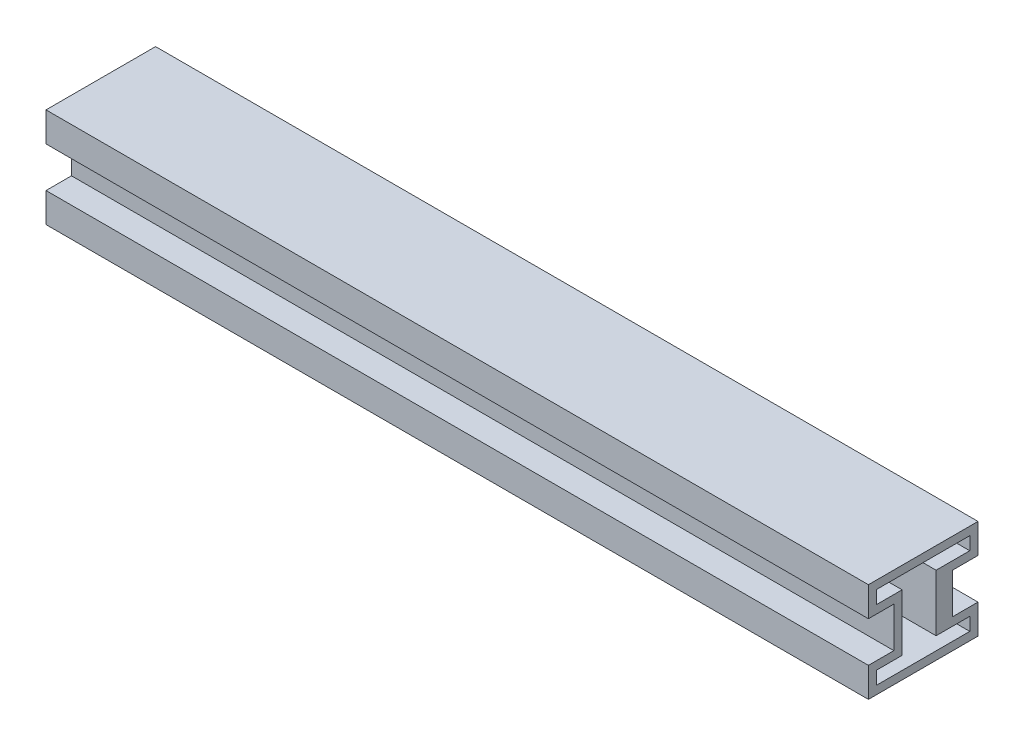
ISO-10303-21;
HEADER;
FILE_DESCRIPTION(('STEP AP214'),'2;1');
FILE_NAME('part.step','',(''),(''),'','','');
FILE_SCHEMA(('AUTOMOTIVE_DESIGN { 1 0 10303 214 1 1 1 1 }'));
ENDSEC;
DATA;
#1=APPLICATION_CONTEXT('core data for automotive mechanical design processes');
#2=APPLICATION_PROTOCOL_DEFINITION('international standard','automotive_design',2000,#1);
#3=PRODUCT_CONTEXT('',#1,'mechanical');
#4=PRODUCT('Part','Part','',(#3));
#5=PRODUCT_RELATED_PRODUCT_CATEGORY('part','',(#4));
#6=PRODUCT_DEFINITION_FORMATION('','',#4);
#7=PRODUCT_DEFINITION_CONTEXT('part definition',#1,'design');
#8=PRODUCT_DEFINITION('design','',#6,#7);
#9=PRODUCT_DEFINITION_SHAPE('','',#8);
#10=(LENGTH_UNIT() NAMED_UNIT(*) SI_UNIT(.MILLI.,.METRE.));
#11=(NAMED_UNIT(*) PLANE_ANGLE_UNIT() SI_UNIT($,.RADIAN.));
#12=(NAMED_UNIT(*) SI_UNIT($,.STERADIAN.) SOLID_ANGLE_UNIT());
#13=UNCERTAINTY_MEASURE_WITH_UNIT(LENGTH_MEASURE(1.E-05),#10,'distance_accuracy_value','');
#14=(GEOMETRIC_REPRESENTATION_CONTEXT(3) GLOBAL_UNCERTAINTY_ASSIGNED_CONTEXT((#13)) GLOBAL_UNIT_ASSIGNED_CONTEXT((#10,
#11,#12)) REPRESENTATION_CONTEXT('',''));
#15=CARTESIAN_POINT('',(0.,0.,0.));
#16=DIRECTION('',(0.,0.,1.));
#17=DIRECTION('',(1.,0.,0.));
#18=AXIS2_PLACEMENT_3D('',#15,#16,#17);
#19=CARTESIAN_POINT('',(1000.,-34.5295294792242,-25.6656272757451));
#20=DIRECTION('',(0.,-1.,0.));
#21=DIRECTION('',(0.,0.,-1.));
#22=AXIS2_PLACEMENT_3D('',#19,#20,#21);
#23=PLANE('',#22);
#24=DIRECTION('',(0.,0.,1.));
#25=VECTOR('',#24,1.);
#26=CARTESIAN_POINT('',(0.,-34.5295294792242,-25.6656272757451));
#27=LINE('',#26,#25);
#28=CARTESIAN_POINT('',(0.,-34.5295294792242,-56.6231364640151));
#29=VERTEX_POINT('',#28);
#30=CARTESIAN_POINT('',(0.,-34.5295294792242,-15.6656272757451));
#31=VERTEX_POINT('',#30);
#32=EDGE_CURVE('E784',#29,#31,#27,.T.);
#33=ORIENTED_EDGE('',*,*,#32,.F.);
#34=DIRECTION('',(-1.,0.,0.));
#35=VECTOR('',#34,1.);
#36=CARTESIAN_POINT('',(1000.,-34.5295294792242,-56.6231364640151));
#37=LINE('',#36,#35);
#38=CARTESIAN_POINT('',(1000.,-34.5295294792242,-56.6231364640151));
#39=VERTEX_POINT('',#38);
#40=EDGE_CURVE('E340',#39,#29,#37,.T.);
#41=ORIENTED_EDGE('',*,*,#40,.F.);
#42=DIRECTION('',(0.,0.,1.));
#43=VECTOR('',#42,1.);
#44=CARTESIAN_POINT('',(1000.,-34.5295294792242,-25.6656272757451));
#45=LINE('',#44,#43);
#46=CARTESIAN_POINT('',(1000.,-34.5295294792242,-15.6656272757451));
#47=VERTEX_POINT('',#46);
#48=EDGE_CURVE('E790',#39,#47,#45,.T.);
#49=ORIENTED_EDGE('',*,*,#48,.T.);
#50=DIRECTION('',(-1.,0.,0.));
#51=VECTOR('',#50,1.);
#52=CARTESIAN_POINT('',(1000.,-34.5295294792242,-15.6656272757451));
#53=LINE('',#52,#51);
#54=EDGE_CURVE('E12',#47,#31,#53,.T.);
#55=ORIENTED_EDGE('',*,*,#54,.T.);
#56=EDGE_LOOP('',(#33,#41,#49,#55));
#57=FACE_BOUND('',#56,.T.);
#58=ADVANCED_FACE('F111',(#57),#23,.T.);
#59=CARTESIAN_POINT('',(1000.,34.5295294792242,-15.6656272757452));
#60=DIRECTION('',(0.,1.,0.));
#61=DIRECTION('',(0.,0.,1.));
#62=AXIS2_PLACEMENT_3D('',#59,#60,#61);
#63=PLANE('',#62);
#64=DIRECTION('',(0.,0.,-1.));
#65=VECTOR('',#64,1.);
#66=CARTESIAN_POINT('',(0.,34.5295294792242,-15.6656272757452));
#67=LINE('',#66,#65);
#68=CARTESIAN_POINT('',(0.,34.5295294792242,-15.6656272757452));
#69=VERTEX_POINT('',#68);
#70=CARTESIAN_POINT('',(0.,34.5295294792242,-56.6231364640152));
#71=VERTEX_POINT('',#70);
#72=EDGE_CURVE('E783',#69,#71,#67,.T.);
#73=ORIENTED_EDGE('',*,*,#72,.F.);
#74=DIRECTION('',(-1.,0.,0.));
#75=VECTOR('',#74,1.);
#76=CARTESIAN_POINT('',(1000.,34.5295294792242,-15.6656272757452));
#77=LINE('',#76,#75);
#78=CARTESIAN_POINT('',(1000.,34.5295294792242,-15.6656272757452));
#79=VERTEX_POINT('',#78);
#80=EDGE_CURVE('E121',#79,#69,#77,.T.);
#81=ORIENTED_EDGE('',*,*,#80,.F.);
#82=DIRECTION('',(0.,0.,-1.));
#83=VECTOR('',#82,1.);
#84=CARTESIAN_POINT('',(1000.,34.5295294792242,-15.6656272757452));
#85=LINE('',#84,#83);
#86=CARTESIAN_POINT('',(1000.,34.5295294792242,-56.6231364640152));
#87=VERTEX_POINT('',#86);
#88=EDGE_CURVE('E794',#79,#87,#85,.T.);
#89=ORIENTED_EDGE('',*,*,#88,.T.);
#90=DIRECTION('',(-1.,0.,0.));
#91=VECTOR('',#90,1.);
#92=CARTESIAN_POINT('',(1000.,34.5295294792242,-56.6231364640152));
#93=LINE('',#92,#91);
#94=EDGE_CURVE('E343',#87,#71,#93,.T.);
#95=ORIENTED_EDGE('',*,*,#94,.T.);
#96=EDGE_LOOP('',(#73,#81,#89,#95));
#97=FACE_BOUND('',#96,.T.);
#98=ADVANCED_FACE('F505',(#97),#63,.T.);
#99=CARTESIAN_POINT('',(1000.,34.5295294792242,-15.6656272757452));
#100=DIRECTION('',(0.,0.,-1.));
#101=DIRECTION('',(0.,1.,0.));
#102=AXIS2_PLACEMENT_3D('',#99,#100,#101);
#103=PLANE('',#102);
#104=DIRECTION('',(0.,-1.,0.));
#105=VECTOR('',#104,1.);
#106=CARTESIAN_POINT('',(0.,34.5295294792242,-15.6656272757452));
#107=LINE('',#106,#105);
#108=EDGE_CURVE('E419',#69,#31,#107,.T.);
#109=ORIENTED_EDGE('',*,*,#108,.T.);
#110=ORIENTED_EDGE('',*,*,#54,.F.);
#111=DIRECTION('',(0.,-1.,0.));
#112=VECTOR('',#111,1.);
#113=CARTESIAN_POINT('',(1000.,34.5295294792242,-15.6656272757452));
#114=LINE('',#113,#112);
#115=EDGE_CURVE('E788',#79,#47,#114,.T.);
#116=ORIENTED_EDGE('',*,*,#115,.F.);
#117=ORIENTED_EDGE('',*,*,#80,.T.);
#118=EDGE_LOOP('',(#109,#110,#116,#117));
#119=FACE_BOUND('',#118,.T.);
#120=ADVANCED_FACE('F511',(#119),#103,.F.);
#121=CARTESIAN_POINT('',(0.,0.,0.));
#122=DIRECTION('',(-1.,0.,0.));
#123=DIRECTION('',(0.,0.,1.));
#124=AXIS2_PLACEMENT_3D('',#121,#122,#123);
#125=PLANE('',#124);
#126=ORIENTED_EDGE('',*,*,#108,.F.);
#127=ORIENTED_EDGE('',*,*,#72,.T.);
#128=DIRECTION('',(0.,-1.,0.));
#129=VECTOR('',#128,1.);
#130=CARTESIAN_POINT('',(0.,0.,-56.6231364640152));
#131=LINE('',#130,#129);
#132=CARTESIAN_POINT('',(0.,50.4051752167986,-56.6231364640152));
#133=VERTEX_POINT('',#132);
#134=EDGE_CURVE('E332',#133,#71,#131,.T.);
#135=ORIENTED_EDGE('',*,*,#134,.F.);
#136=DIRECTION('',(0.,0.,1.));
#137=VECTOR('',#136,1.);
#138=CARTESIAN_POINT('',(0.,50.4051752167986,0.));
#139=LINE('',#138,#137);
#140=CARTESIAN_POINT('',(0.,50.4051752167986,56.6231364640152));
#141=VERTEX_POINT('',#140);
#142=EDGE_CURVE('E329',#133,#141,#139,.T.);
#143=ORIENTED_EDGE('',*,*,#142,.T.);
#144=DIRECTION('',(0.,-1.,0.));
#145=VECTOR('',#144,1.);
#146=CARTESIAN_POINT('',(0.,0.,56.6231364640152));
#147=LINE('',#146,#145);
#148=CARTESIAN_POINT('',(0.,34.5295294792242,56.6231364640152));
#149=VERTEX_POINT('',#148);
#150=EDGE_CURVE('E326',#141,#149,#147,.T.);
#151=ORIENTED_EDGE('',*,*,#150,.T.);
#152=DIRECTION('',(0.,0.,-1.));
#153=VECTOR('',#152,1.);
#154=CARTESIAN_POINT('',(0.,34.5295294792242,0.));
#155=LINE('',#154,#153);
#156=CARTESIAN_POINT('',(0.,34.5295294792242,25.6656272757452));
#157=VERTEX_POINT('',#156);
#158=EDGE_CURVE('E323',#149,#157,#155,.T.);
#159=ORIENTED_EDGE('',*,*,#158,.T.);
#160=DIRECTION('',(0.,-1.,0.));
#161=VECTOR('',#160,1.);
#162=CARTESIAN_POINT('',(0.,0.,25.6656272757452));
#163=LINE('',#162,#161);
#164=CARTESIAN_POINT('',(0.,-34.5295294792242,25.6656272757452));
#165=VERTEX_POINT('',#164);
#166=EDGE_CURVE('E320',#157,#165,#163,.T.);
#167=ORIENTED_EDGE('',*,*,#166,.T.);
#168=DIRECTION('',(0.,0.,-1.));
#169=VECTOR('',#168,1.);
#170=CARTESIAN_POINT('',(0.,-34.5295294792242,0.));
#171=LINE('',#170,#169);
#172=CARTESIAN_POINT('',(0.,-34.5295294792242,56.6231364640152));
#173=VERTEX_POINT('',#172);
#174=EDGE_CURVE('E318',#173,#165,#171,.T.);
#175=ORIENTED_EDGE('',*,*,#174,.F.);
#176=DIRECTION('',(0.,1.,0.));
#177=VECTOR('',#176,1.);
#178=CARTESIAN_POINT('',(0.,0.,56.6231364640152));
#179=LINE('',#178,#177);
#180=CARTESIAN_POINT('',(0.,-50.4051752167986,56.6231364640152));
#181=VERTEX_POINT('',#180);
#182=EDGE_CURVE('E290',#181,#173,#179,.T.);
#183=ORIENTED_EDGE('',*,*,#182,.F.);
#184=DIRECTION('',(0.,0.,1.));
#185=VECTOR('',#184,1.);
#186=CARTESIAN_POINT('',(0.,-50.4051752167986,0.));
#187=LINE('',#186,#185);
#188=CARTESIAN_POINT('',(0.,-50.4051752167986,-56.6231364640151));
#189=VERTEX_POINT('',#188);
#190=EDGE_CURVE('E266',#189,#181,#187,.T.);
#191=ORIENTED_EDGE('',*,*,#190,.F.);
#192=DIRECTION('',(0.,1.,0.));
#193=VECTOR('',#192,1.);
#194=CARTESIAN_POINT('',(0.,0.,-56.6231364640151));
#195=LINE('',#194,#193);
#196=EDGE_CURVE('E300',#189,#29,#195,.T.);
#197=ORIENTED_EDGE('',*,*,#196,.T.);
#198=ORIENTED_EDGE('',*,*,#32,.T.);
#199=EDGE_LOOP('',(#126,#127,#135,#143,#151,#159,#167,#175,#183,#191,#197,#198));
#200=FACE_BOUND('',#199,.T.);
#201=DIRECTION('',(0.,0.,1.));
#202=VECTOR('',#201,1.);
#203=CARTESIAN_POINT('',(0.,-60.4051752167986,0.));
#204=LINE('',#203,#202);
#205=CARTESIAN_POINT('',(0.,-60.4051752167986,-66.6231364640151));
#206=VERTEX_POINT('',#205);
#207=CARTESIAN_POINT('',(0.,-60.4051752167986,66.6231364640152));
#208=VERTEX_POINT('',#207);
#209=EDGE_CURVE('E339',#206,#208,#204,.T.);
#210=ORIENTED_EDGE('',*,*,#209,.T.);
#211=DIRECTION('',(0.,1.,0.));
#212=VECTOR('',#211,1.);
#213=CARTESIAN_POINT('',(0.,0.,66.6231364640152));
#214=LINE('',#213,#212);
#215=CARTESIAN_POINT('',(0.,-24.5295294792242,66.6231364640152));
#216=VERTEX_POINT('',#215);
#217=EDGE_CURVE('E389',#208,#216,#214,.T.);
#218=ORIENTED_EDGE('',*,*,#217,.T.);
#219=DIRECTION('',(0.,0.,-1.));
#220=VECTOR('',#219,1.);
#221=CARTESIAN_POINT('',(0.,-24.5295294792242,0.));
#222=LINE('',#221,#220);
#223=CARTESIAN_POINT('',(0.,-24.5295294792242,35.6656272757452));
#224=VERTEX_POINT('',#223);
#225=EDGE_CURVE('E392',#216,#224,#222,.T.);
#226=ORIENTED_EDGE('',*,*,#225,.T.);
#227=DIRECTION('',(0.,-1.,0.));
#228=VECTOR('',#227,1.);
#229=CARTESIAN_POINT('',(0.,0.,35.6656272757452));
#230=LINE('',#229,#228);
#231=CARTESIAN_POINT('',(0.,24.5295294792242,35.6656272757452));
#232=VERTEX_POINT('',#231);
#233=EDGE_CURVE('E395',#232,#224,#230,.T.);
#234=ORIENTED_EDGE('',*,*,#233,.F.);
#235=DIRECTION('',(0.,0.,-1.));
#236=VECTOR('',#235,1.);
#237=CARTESIAN_POINT('',(0.,24.5295294792242,0.));
#238=LINE('',#237,#236);
#239=CARTESIAN_POINT('',(0.,24.5295294792242,66.6231364640152));
#240=VERTEX_POINT('',#239);
#241=EDGE_CURVE('E398',#240,#232,#238,.T.);
#242=ORIENTED_EDGE('',*,*,#241,.F.);
#243=DIRECTION('',(0.,-1.,0.));
#244=VECTOR('',#243,1.);
#245=CARTESIAN_POINT('',(0.,0.,66.6231364640152));
#246=LINE('',#245,#244);
#247=CARTESIAN_POINT('',(0.,60.4051752167986,66.6231364640152));
#248=VERTEX_POINT('',#247);
#249=EDGE_CURVE('E400',#248,#240,#246,.T.);
#250=ORIENTED_EDGE('',*,*,#249,.F.);
#251=DIRECTION('',(0.,0.,1.));
#252=VECTOR('',#251,1.);
#253=CARTESIAN_POINT('',(0.,60.4051752167986,0.));
#254=LINE('',#253,#252);
#255=CARTESIAN_POINT('',(0.,60.4051752167986,-66.6231364640152));
#256=VERTEX_POINT('',#255);
#257=EDGE_CURVE('E402',#256,#248,#254,.T.);
#258=ORIENTED_EDGE('',*,*,#257,.F.);
#259=DIRECTION('',(0.,-1.,0.));
#260=VECTOR('',#259,1.);
#261=CARTESIAN_POINT('',(0.,0.,-66.6231364640152));
#262=LINE('',#261,#260);
#263=CARTESIAN_POINT('',(0.,24.5295294792242,-66.6231364640152));
#264=VERTEX_POINT('',#263);
#265=EDGE_CURVE('E404',#256,#264,#262,.T.);
#266=ORIENTED_EDGE('',*,*,#265,.T.);
#267=DIRECTION('',(0.,0.,1.));
#268=VECTOR('',#267,1.);
#269=CARTESIAN_POINT('',(0.,24.5295294792242,0.));
#270=LINE('',#269,#268);
#271=CARTESIAN_POINT('',(0.,24.5295294792242,-35.6656272757452));
#272=VERTEX_POINT('',#271);
#273=EDGE_CURVE('E407',#264,#272,#270,.T.);
#274=ORIENTED_EDGE('',*,*,#273,.T.);
#275=DIRECTION('',(0.,-1.,0.));
#276=VECTOR('',#275,1.);
#277=CARTESIAN_POINT('',(0.,0.,-35.6656272757451));
#278=LINE('',#277,#276);
#279=CARTESIAN_POINT('',(0.,-24.5295294792242,-35.6656272757451));
#280=VERTEX_POINT('',#279);
#281=EDGE_CURVE('E410',#272,#280,#278,.T.);
#282=ORIENTED_EDGE('',*,*,#281,.T.);
#283=DIRECTION('',(0.,0.,1.));
#284=VECTOR('',#283,1.);
#285=CARTESIAN_POINT('',(0.,-24.5295294792242,0.));
#286=LINE('',#285,#284);
#287=CARTESIAN_POINT('',(0.,-24.5295294792242,-66.6231364640151));
#288=VERTEX_POINT('',#287);
#289=EDGE_CURVE('E413',#288,#280,#286,.T.);
#290=ORIENTED_EDGE('',*,*,#289,.F.);
#291=DIRECTION('',(0.,1.,0.));
#292=VECTOR('',#291,1.);
#293=CARTESIAN_POINT('',(0.,0.,-66.6231364640151));
#294=LINE('',#293,#292);
#295=EDGE_CURVE('E360',#206,#288,#294,.T.);
#296=ORIENTED_EDGE('',*,*,#295,.F.);
#297=EDGE_LOOP('',(#210,#218,#226,#234,#242,#250,#258,#266,#274,#282,#290,#296));
#298=FACE_BOUND('',#297,.T.);
#299=ADVANCED_FACE('F452',(#200,#298),#125,.T.);
#300=CARTESIAN_POINT('',(1000.,0.,0.));
#301=DIRECTION('',(-1.,0.,0.));
#302=DIRECTION('',(0.,0.,1.));
#303=AXIS2_PLACEMENT_3D('',#300,#301,#302);
#304=PLANE('',#303);
#305=ORIENTED_EDGE('',*,*,#115,.T.);
#306=ORIENTED_EDGE('',*,*,#48,.F.);
#307=DIRECTION('',(0.,1.,0.));
#308=VECTOR('',#307,1.);
#309=CARTESIAN_POINT('',(1000.,0.,-56.6231364640151));
#310=LINE('',#309,#308);
#311=CARTESIAN_POINT('',(1000.,-50.4051752167986,-56.6231364640151));
#312=VERTEX_POINT('',#311);
#313=EDGE_CURVE('E313',#312,#39,#310,.T.);
#314=ORIENTED_EDGE('',*,*,#313,.F.);
#315=DIRECTION('',(0.,0.,1.));
#316=VECTOR('',#315,1.);
#317=CARTESIAN_POINT('',(1000.,-50.4051752167986,0.));
#318=LINE('',#317,#316);
#319=CARTESIAN_POINT('',(1000.,-50.4051752167986,56.6231364640152));
#320=VERTEX_POINT('',#319);
#321=EDGE_CURVE('E298',#312,#320,#318,.T.);
#322=ORIENTED_EDGE('',*,*,#321,.T.);
#323=DIRECTION('',(0.,1.,0.));
#324=VECTOR('',#323,1.);
#325=CARTESIAN_POINT('',(1000.,0.,56.6231364640152));
#326=LINE('',#325,#324);
#327=CARTESIAN_POINT('',(1000.,-34.5295294792242,56.6231364640152));
#328=VERTEX_POINT('',#327);
#329=EDGE_CURVE('E283',#320,#328,#326,.T.);
#330=ORIENTED_EDGE('',*,*,#329,.T.);
#331=DIRECTION('',(0.,0.,-1.));
#332=VECTOR('',#331,1.);
#333=CARTESIAN_POINT('',(1000.,-34.5295294792242,0.));
#334=LINE('',#333,#332);
#335=CARTESIAN_POINT('',(1000.,-34.5295294792242,25.6656272757452));
#336=VERTEX_POINT('',#335);
#337=EDGE_CURVE('E272',#328,#336,#334,.T.);
#338=ORIENTED_EDGE('',*,*,#337,.T.);
#339=DIRECTION('',(0.,-1.,0.));
#340=VECTOR('',#339,1.);
#341=CARTESIAN_POINT('',(1000.,0.,25.6656272757452));
#342=LINE('',#341,#340);
#343=CARTESIAN_POINT('',(1000.,34.5295294792242,25.6656272757452));
#344=VERTEX_POINT('',#343);
#345=EDGE_CURVE('E282',#344,#336,#342,.T.);
#346=ORIENTED_EDGE('',*,*,#345,.F.);
#347=DIRECTION('',(0.,0.,-1.));
#348=VECTOR('',#347,1.);
#349=CARTESIAN_POINT('',(1000.,34.5295294792242,0.));
#350=LINE('',#349,#348);
#351=CARTESIAN_POINT('',(1000.,34.5295294792242,56.6231364640152));
#352=VERTEX_POINT('',#351);
#353=EDGE_CURVE('E304',#352,#344,#350,.T.);
#354=ORIENTED_EDGE('',*,*,#353,.F.);
#355=DIRECTION('',(0.,-1.,0.));
#356=VECTOR('',#355,1.);
#357=CARTESIAN_POINT('',(1000.,0.,56.6231364640152));
#358=LINE('',#357,#356);
#359=CARTESIAN_POINT('',(1000.,50.4051752167986,56.6231364640152));
#360=VERTEX_POINT('',#359);
#361=EDGE_CURVE('E306',#360,#352,#358,.T.);
#362=ORIENTED_EDGE('',*,*,#361,.F.);
#363=DIRECTION('',(0.,0.,1.));
#364=VECTOR('',#363,1.);
#365=CARTESIAN_POINT('',(1000.,50.4051752167986,0.));
#366=LINE('',#365,#364);
#367=CARTESIAN_POINT('',(1000.,50.4051752167986,-56.6231364640152));
#368=VERTEX_POINT('',#367);
#369=EDGE_CURVE('E308',#368,#360,#366,.T.);
#370=ORIENTED_EDGE('',*,*,#369,.F.);
#371=DIRECTION('',(0.,-1.,0.));
#372=VECTOR('',#371,1.);
#373=CARTESIAN_POINT('',(1000.,0.,-56.6231364640152));
#374=LINE('',#373,#372);
#375=EDGE_CURVE('E310',#368,#87,#374,.T.);
#376=ORIENTED_EDGE('',*,*,#375,.T.);
#377=ORIENTED_EDGE('',*,*,#88,.F.);
#378=EDGE_LOOP('',(#305,#306,#314,#322,#330,#338,#346,#354,#362,#370,#376,#377));
#379=FACE_BOUND('',#378,.T.);
#380=DIRECTION('',(0.,0.,1.));
#381=VECTOR('',#380,1.);
#382=CARTESIAN_POINT('',(1000.,-60.4051752167986,0.));
#383=LINE('',#382,#381);
#384=CARTESIAN_POINT('',(1000.,-60.4051752167986,-66.6231364640151));
#385=VERTEX_POINT('',#384);
#386=CARTESIAN_POINT('',(1000.,-60.4051752167986,66.6231364640152));
#387=VERTEX_POINT('',#386);
#388=EDGE_CURVE('E356',#385,#387,#383,.T.);
#389=ORIENTED_EDGE('',*,*,#388,.F.);
#390=DIRECTION('',(0.,1.,0.));
#391=VECTOR('',#390,1.);
#392=CARTESIAN_POINT('',(1000.,0.,-66.6231364640151));
#393=LINE('',#392,#391);
#394=CARTESIAN_POINT('',(1000.,-24.5295294792242,-66.6231364640151));
#395=VERTEX_POINT('',#394);
#396=EDGE_CURVE('E385',#385,#395,#393,.T.);
#397=ORIENTED_EDGE('',*,*,#396,.T.);
#398=DIRECTION('',(0.,0.,1.));
#399=VECTOR('',#398,1.);
#400=CARTESIAN_POINT('',(1000.,-24.5295294792242,0.));
#401=LINE('',#400,#399);
#402=CARTESIAN_POINT('',(1000.,-24.5295294792242,-35.6656272757451));
#403=VERTEX_POINT('',#402);
#404=EDGE_CURVE('E383',#395,#403,#401,.T.);
#405=ORIENTED_EDGE('',*,*,#404,.T.);
#406=DIRECTION('',(0.,-1.,0.));
#407=VECTOR('',#406,1.);
#408=CARTESIAN_POINT('',(1000.,0.,-35.6656272757451));
#409=LINE('',#408,#407);
#410=CARTESIAN_POINT('',(1000.,24.5295294792242,-35.6656272757452));
#411=VERTEX_POINT('',#410);
#412=EDGE_CURVE('E380',#411,#403,#409,.T.);
#413=ORIENTED_EDGE('',*,*,#412,.F.);
#414=DIRECTION('',(0.,0.,1.));
#415=VECTOR('',#414,1.);
#416=CARTESIAN_POINT('',(1000.,24.5295294792242,0.));
#417=LINE('',#416,#415);
#418=CARTESIAN_POINT('',(1000.,24.5295294792242,-66.6231364640152));
#419=VERTEX_POINT('',#418);
#420=EDGE_CURVE('E377',#419,#411,#417,.T.);
#421=ORIENTED_EDGE('',*,*,#420,.F.);
#422=DIRECTION('',(0.,-1.,0.));
#423=VECTOR('',#422,1.);
#424=CARTESIAN_POINT('',(1000.,0.,-66.6231364640152));
#425=LINE('',#424,#423);
#426=CARTESIAN_POINT('',(1000.,60.4051752167986,-66.6231364640152));
#427=VERTEX_POINT('',#426);
#428=EDGE_CURVE('E374',#427,#419,#425,.T.);
#429=ORIENTED_EDGE('',*,*,#428,.F.);
#430=DIRECTION('',(0.,0.,1.));
#431=VECTOR('',#430,1.);
#432=CARTESIAN_POINT('',(1000.,60.4051752167986,0.));
#433=LINE('',#432,#431);
#434=CARTESIAN_POINT('',(1000.,60.4051752167986,66.6231364640152));
#435=VERTEX_POINT('',#434);
#436=EDGE_CURVE('E372',#427,#435,#433,.T.);
#437=ORIENTED_EDGE('',*,*,#436,.T.);
#438=DIRECTION('',(0.,-1.,0.));
#439=VECTOR('',#438,1.);
#440=CARTESIAN_POINT('',(1000.,0.,66.6231364640152));
#441=LINE('',#440,#439);
#442=CARTESIAN_POINT('',(1000.,24.5295294792242,66.6231364640152));
#443=VERTEX_POINT('',#442);
#444=EDGE_CURVE('E370',#435,#443,#441,.T.);
#445=ORIENTED_EDGE('',*,*,#444,.T.);
#446=DIRECTION('',(0.,0.,-1.));
#447=VECTOR('',#446,1.);
#448=CARTESIAN_POINT('',(1000.,24.5295294792242,0.));
#449=LINE('',#448,#447);
#450=CARTESIAN_POINT('',(1000.,24.5295294792242,35.6656272757452));
#451=VERTEX_POINT('',#450);
#452=EDGE_CURVE('E368',#443,#451,#449,.T.);
#453=ORIENTED_EDGE('',*,*,#452,.T.);
#454=DIRECTION('',(0.,-1.,0.));
#455=VECTOR('',#454,1.);
#456=CARTESIAN_POINT('',(1000.,0.,35.6656272757452));
#457=LINE('',#456,#455);
#458=CARTESIAN_POINT('',(1000.,-24.5295294792242,35.6656272757452));
#459=VERTEX_POINT('',#458);
#460=EDGE_CURVE('E366',#451,#459,#457,.T.);
#461=ORIENTED_EDGE('',*,*,#460,.T.);
#462=DIRECTION('',(0.,0.,-1.));
#463=VECTOR('',#462,1.);
#464=CARTESIAN_POINT('',(1000.,-24.5295294792242,0.));
#465=LINE('',#464,#463);
#466=CARTESIAN_POINT('',(1000.,-24.5295294792242,66.6231364640152));
#467=VERTEX_POINT('',#466);
#468=EDGE_CURVE('E363',#467,#459,#465,.T.);
#469=ORIENTED_EDGE('',*,*,#468,.F.);
#470=DIRECTION('',(0.,1.,0.));
#471=VECTOR('',#470,1.);
#472=CARTESIAN_POINT('',(1000.,0.,66.6231364640152));
#473=LINE('',#472,#471);
#474=EDGE_CURVE('E359',#387,#467,#473,.T.);
#475=ORIENTED_EDGE('',*,*,#474,.F.);
#476=EDGE_LOOP('',(#389,#397,#405,#413,#421,#429,#437,#445,#453,#461,#469,#475));
#477=FACE_BOUND('',#476,.T.);
#478=ADVANCED_FACE('F294',(#379,#477),#304,.F.);
#479=CARTESIAN_POINT('',(1000.,0.,-66.6231364640151));
#480=DIRECTION('',(0.,0.,1.));
#481=DIRECTION('',(1.,0.,0.));
#482=AXIS2_PLACEMENT_3D('',#479,#480,#481);
#483=PLANE('',#482);
#484=ORIENTED_EDGE('',*,*,#295,.T.);
#485=DIRECTION('',(-1.,0.,0.));
#486=VECTOR('',#485,1.);
#487=CARTESIAN_POINT('',(1000.,-24.5295294792242,-66.6231364640151));
#488=LINE('',#487,#486);
#489=EDGE_CURVE('E420',#395,#288,#488,.T.);
#490=ORIENTED_EDGE('',*,*,#489,.F.);
#491=ORIENTED_EDGE('',*,*,#396,.F.);
#492=DIRECTION('',(-1.,0.,0.));
#493=VECTOR('',#492,1.);
#494=CARTESIAN_POINT('',(1000.,-60.4051752167986,-66.6231364640151));
#495=LINE('',#494,#493);
#496=EDGE_CURVE('E417',#385,#206,#495,.T.);
#497=ORIENTED_EDGE('',*,*,#496,.T.);
#498=EDGE_LOOP('',(#484,#490,#491,#497));
#499=FACE_BOUND('',#498,.T.);
#500=ADVANCED_FACE('F456',(#499),#483,.F.);
#501=CARTESIAN_POINT('',(1000.,-24.5295294792242,0.));
#502=DIRECTION('',(0.,-1.,0.));
#503=DIRECTION('',(0.,0.,-1.));
#504=AXIS2_PLACEMENT_3D('',#501,#502,#503);
#505=PLANE('',#504);
#506=ORIENTED_EDGE('',*,*,#289,.T.);
#507=DIRECTION('',(-1.,0.,0.));
#508=VECTOR('',#507,1.);
#509=CARTESIAN_POINT('',(1000.,-24.5295294792242,-35.6656272757451));
#510=LINE('',#509,#508);
#511=EDGE_CURVE('E423',#403,#280,#510,.T.);
#512=ORIENTED_EDGE('',*,*,#511,.F.);
#513=ORIENTED_EDGE('',*,*,#404,.F.);
#514=ORIENTED_EDGE('',*,*,#489,.T.);
#515=EDGE_LOOP('',(#506,#512,#513,#514));
#516=FACE_BOUND('',#515,.T.);
#517=ADVANCED_FACE('F460',(#516),#505,.F.);
#518=CARTESIAN_POINT('',(1000.,0.,-35.6656272757451));
#519=DIRECTION('',(0.,0.,-1.));
#520=DIRECTION('',(0.,1.,0.));
#521=AXIS2_PLACEMENT_3D('',#518,#519,#520);
#522=PLANE('',#521);
#523=ORIENTED_EDGE('',*,*,#281,.F.);
#524=DIRECTION('',(-1.,0.,0.));
#525=VECTOR('',#524,1.);
#526=CARTESIAN_POINT('',(1000.,24.5295294792242,-35.6656272757452));
#527=LINE('',#526,#525);
#528=EDGE_CURVE('E425',#411,#272,#527,.T.);
#529=ORIENTED_EDGE('',*,*,#528,.F.);
#530=ORIENTED_EDGE('',*,*,#412,.T.);
#531=ORIENTED_EDGE('',*,*,#511,.T.);
#532=EDGE_LOOP('',(#523,#529,#530,#531));
#533=FACE_BOUND('',#532,.T.);
#534=ADVANCED_FACE('F495',(#533),#522,.T.);
#535=CARTESIAN_POINT('',(1000.,24.5295294792242,0.));
#536=DIRECTION('',(0.,-1.,0.));
#537=DIRECTION('',(0.,0.,-1.));
#538=AXIS2_PLACEMENT_3D('',#535,#536,#537);
#539=PLANE('',#538);
#540=ORIENTED_EDGE('',*,*,#273,.F.);
#541=DIRECTION('',(-1.,0.,0.));
#542=VECTOR('',#541,1.);
#543=CARTESIAN_POINT('',(1000.,24.5295294792242,-66.6231364640152));
#544=LINE('',#543,#542);
#545=EDGE_CURVE('E427',#419,#264,#544,.T.);
#546=ORIENTED_EDGE('',*,*,#545,.F.);
#547=ORIENTED_EDGE('',*,*,#420,.T.);
#548=ORIENTED_EDGE('',*,*,#528,.T.);
#549=EDGE_LOOP('',(#540,#546,#547,#548));
#550=FACE_BOUND('',#549,.T.);
#551=ADVANCED_FACE('F492',(#550),#539,.T.);
#552=CARTESIAN_POINT('',(1000.,0.,-66.6231364640152));
#553=DIRECTION('',(0.,0.,-1.));
#554=DIRECTION('',(-1.,0.,0.));
#555=AXIS2_PLACEMENT_3D('',#552,#553,#554);
#556=PLANE('',#555);
#557=ORIENTED_EDGE('',*,*,#265,.F.);
#558=DIRECTION('',(-1.,0.,0.));
#559=VECTOR('',#558,1.);
#560=CARTESIAN_POINT('',(1000.,60.4051752167986,-66.6231364640152));
#561=LINE('',#560,#559);
#562=EDGE_CURVE('E429',#427,#256,#561,.T.);
#563=ORIENTED_EDGE('',*,*,#562,.F.);
#564=ORIENTED_EDGE('',*,*,#428,.T.);
#565=ORIENTED_EDGE('',*,*,#545,.T.);
#566=EDGE_LOOP('',(#557,#563,#564,#565));
#567=FACE_BOUND('',#566,.T.);
#568=ADVANCED_FACE('F487',(#567),#556,.T.);
#569=CARTESIAN_POINT('',(1000.,60.4051752167986,0.));
#570=DIRECTION('',(0.,-1.,0.));
#571=DIRECTION('',(0.,0.,-1.));
#572=AXIS2_PLACEMENT_3D('',#569,#570,#571);
#573=PLANE('',#572);
#574=ORIENTED_EDGE('',*,*,#257,.T.);
#575=DIRECTION('',(-1.,0.,0.));
#576=VECTOR('',#575,1.);
#577=CARTESIAN_POINT('',(1000.,60.4051752167986,66.6231364640152));
#578=LINE('',#577,#576);
#579=EDGE_CURVE('E431',#435,#248,#578,.T.);
#580=ORIENTED_EDGE('',*,*,#579,.F.);
#581=ORIENTED_EDGE('',*,*,#436,.F.);
#582=ORIENTED_EDGE('',*,*,#562,.T.);
#583=EDGE_LOOP('',(#574,#580,#581,#582));
#584=FACE_BOUND('',#583,.T.);
#585=ADVANCED_FACE('F569',(#584),#573,.F.);
#586=CARTESIAN_POINT('',(1000.,0.,66.6231364640152));
#587=DIRECTION('',(0.,0.,-1.));
#588=DIRECTION('',(-1.,0.,0.));
#589=AXIS2_PLACEMENT_3D('',#586,#587,#588);
#590=PLANE('',#589);
#591=ORIENTED_EDGE('',*,*,#249,.T.);
#592=DIRECTION('',(-1.,0.,0.));
#593=VECTOR('',#592,1.);
#594=CARTESIAN_POINT('',(1000.,24.5295294792242,66.6231364640152));
#595=LINE('',#594,#593);
#596=EDGE_CURVE('E434',#443,#240,#595,.T.);
#597=ORIENTED_EDGE('',*,*,#596,.F.);
#598=ORIENTED_EDGE('',*,*,#444,.F.);
#599=ORIENTED_EDGE('',*,*,#579,.T.);
#600=EDGE_LOOP('',(#591,#597,#598,#599));
#601=FACE_BOUND('',#600,.T.);
#602=ADVANCED_FACE('F481',(#601),#590,.F.);
#603=CARTESIAN_POINT('',(1000.,24.5295294792242,0.));
#604=DIRECTION('',(0.,1.,0.));
#605=DIRECTION('',(0.,0.,1.));
#606=AXIS2_PLACEMENT_3D('',#603,#604,#605);
#607=PLANE('',#606);
#608=ORIENTED_EDGE('',*,*,#241,.T.);
#609=DIRECTION('',(-1.,0.,0.));
#610=VECTOR('',#609,1.);
#611=CARTESIAN_POINT('',(1000.,24.5295294792242,35.6656272757452));
#612=LINE('',#611,#610);
#613=EDGE_CURVE('E437',#451,#232,#612,.T.);
#614=ORIENTED_EDGE('',*,*,#613,.F.);
#615=ORIENTED_EDGE('',*,*,#452,.F.);
#616=ORIENTED_EDGE('',*,*,#596,.T.);
#617=EDGE_LOOP('',(#608,#614,#615,#616));
#618=FACE_BOUND('',#617,.T.);
#619=ADVANCED_FACE('F477',(#618),#607,.F.);
#620=CARTESIAN_POINT('',(1000.,0.,35.6656272757452));
#621=DIRECTION('',(0.,0.,-1.));
#622=DIRECTION('',(0.,1.,0.));
#623=AXIS2_PLACEMENT_3D('',#620,#621,#622);
#624=PLANE('',#623);
#625=ORIENTED_EDGE('',*,*,#233,.T.);
#626=DIRECTION('',(-1.,0.,0.));
#627=VECTOR('',#626,1.);
#628=CARTESIAN_POINT('',(1000.,-24.5295294792242,35.6656272757452));
#629=LINE('',#628,#627);
#630=EDGE_CURVE('E440',#459,#224,#629,.T.);
#631=ORIENTED_EDGE('',*,*,#630,.F.);
#632=ORIENTED_EDGE('',*,*,#460,.F.);
#633=ORIENTED_EDGE('',*,*,#613,.T.);
#634=EDGE_LOOP('',(#625,#631,#632,#633));
#635=FACE_BOUND('',#634,.T.);
#636=ADVANCED_FACE('F473',(#635),#624,.F.);
#637=CARTESIAN_POINT('',(1000.,-24.5295294792242,0.));
#638=DIRECTION('',(0.,1.,0.));
#639=DIRECTION('',(0.,0.,1.));
#640=AXIS2_PLACEMENT_3D('',#637,#638,#639);
#641=PLANE('',#640);
#642=ORIENTED_EDGE('',*,*,#225,.F.);
#643=DIRECTION('',(-1.,0.,0.));
#644=VECTOR('',#643,1.);
#645=CARTESIAN_POINT('',(1000.,-24.5295294792242,66.6231364640152));
#646=LINE('',#645,#644);
#647=EDGE_CURVE('E441',#467,#216,#646,.T.);
#648=ORIENTED_EDGE('',*,*,#647,.F.);
#649=ORIENTED_EDGE('',*,*,#468,.T.);
#650=ORIENTED_EDGE('',*,*,#630,.T.);
#651=EDGE_LOOP('',(#642,#648,#649,#650));
#652=FACE_BOUND('',#651,.T.);
#653=ADVANCED_FACE('F468',(#652),#641,.T.);
#654=CARTESIAN_POINT('',(1000.,0.,66.6231364640152));
#655=DIRECTION('',(0.,0.,1.));
#656=DIRECTION('',(1.,0.,0.));
#657=AXIS2_PLACEMENT_3D('',#654,#655,#656);
#658=PLANE('',#657);
#659=ORIENTED_EDGE('',*,*,#217,.F.);
#660=DIRECTION('',(-1.,0.,0.));
#661=VECTOR('',#660,1.);
#662=CARTESIAN_POINT('',(1000.,-60.4051752167986,66.6231364640152));
#663=LINE('',#662,#661);
#664=EDGE_CURVE('E115',#387,#208,#663,.T.);
#665=ORIENTED_EDGE('',*,*,#664,.F.);
#666=ORIENTED_EDGE('',*,*,#474,.T.);
#667=ORIENTED_EDGE('',*,*,#647,.T.);
#668=EDGE_LOOP('',(#659,#665,#666,#667));
#669=FACE_BOUND('',#668,.T.);
#670=ADVANCED_FACE('F449',(#669),#658,.T.);
#671=CARTESIAN_POINT('',(1000.,-60.4051752167986,0.));
#672=DIRECTION('',(0.,-1.,0.));
#673=DIRECTION('',(0.,0.,-1.));
#674=AXIS2_PLACEMENT_3D('',#671,#672,#673);
#675=PLANE('',#674);
#676=ORIENTED_EDGE('',*,*,#209,.F.);
#677=ORIENTED_EDGE('',*,*,#496,.F.);
#678=ORIENTED_EDGE('',*,*,#388,.T.);
#679=ORIENTED_EDGE('',*,*,#664,.T.);
#680=EDGE_LOOP('',(#676,#677,#678,#679));
#681=FACE_BOUND('',#680,.T.);
#682=ADVANCED_FACE('F113',(#681),#675,.T.);
#683=CARTESIAN_POINT('',(1000.,0.,56.6231364640152));
#684=DIRECTION('',(0.,0.,1.));
#685=DIRECTION('',(1.,0.,0.));
#686=AXIS2_PLACEMENT_3D('',#683,#684,#685);
#687=PLANE('',#686);
#688=ORIENTED_EDGE('',*,*,#182,.T.);
#689=DIRECTION('',(-1.,0.,0.));
#690=VECTOR('',#689,1.);
#691=CARTESIAN_POINT('',(1000.,-34.5295294792242,56.6231364640152));
#692=LINE('',#691,#690);
#693=EDGE_CURVE('E276',#328,#173,#692,.T.);
#694=ORIENTED_EDGE('',*,*,#693,.F.);
#695=ORIENTED_EDGE('',*,*,#329,.F.);
#696=DIRECTION('',(-1.,0.,0.));
#697=VECTOR('',#696,1.);
#698=CARTESIAN_POINT('',(1000.,-50.4051752167986,56.6231364640152));
#699=LINE('',#698,#697);
#700=EDGE_CURVE('E292',#320,#181,#699,.T.);
#701=ORIENTED_EDGE('',*,*,#700,.T.);
#702=EDGE_LOOP('',(#688,#694,#695,#701));
#703=FACE_BOUND('',#702,.T.);
#704=ADVANCED_FACE('F287',(#703),#687,.F.);
#705=CARTESIAN_POINT('',(1000.,-34.5295294792242,0.));
#706=DIRECTION('',(0.,1.,0.));
#707=DIRECTION('',(0.,0.,1.));
#708=AXIS2_PLACEMENT_3D('',#705,#706,#707);
#709=PLANE('',#708);
#710=ORIENTED_EDGE('',*,*,#174,.T.);
#711=DIRECTION('',(-1.,0.,0.));
#712=VECTOR('',#711,1.);
#713=CARTESIAN_POINT('',(1000.,-34.5295294792242,25.6656272757452));
#714=LINE('',#713,#712);
#715=EDGE_CURVE('E278',#336,#165,#714,.T.);
#716=ORIENTED_EDGE('',*,*,#715,.F.);
#717=ORIENTED_EDGE('',*,*,#337,.F.);
#718=ORIENTED_EDGE('',*,*,#693,.T.);
#719=EDGE_LOOP('',(#710,#716,#717,#718));
#720=FACE_BOUND('',#719,.T.);
#721=ADVANCED_FACE('F275',(#720),#709,.F.);
#722=CARTESIAN_POINT('',(1000.,0.,25.6656272757452));
#723=DIRECTION('',(0.,0.,-1.));
#724=DIRECTION('',(0.,1.,0.));
#725=AXIS2_PLACEMENT_3D('',#722,#723,#724);
#726=PLANE('',#725);
#727=ORIENTED_EDGE('',*,*,#166,.F.);
#728=DIRECTION('',(-1.,0.,0.));
#729=VECTOR('',#728,1.);
#730=CARTESIAN_POINT('',(1000.,34.5295294792242,25.6656272757452));
#731=LINE('',#730,#729);
#732=EDGE_CURVE('E352',#344,#157,#731,.T.);
#733=ORIENTED_EDGE('',*,*,#732,.F.);
#734=ORIENTED_EDGE('',*,*,#345,.T.);
#735=ORIENTED_EDGE('',*,*,#715,.T.);
#736=EDGE_LOOP('',(#727,#733,#734,#735));
#737=FACE_BOUND('',#736,.T.);
#738=ADVANCED_FACE('F538',(#737),#726,.T.);
#739=CARTESIAN_POINT('',(1000.,34.5295294792242,0.));
#740=DIRECTION('',(0.,1.,0.));
#741=DIRECTION('',(0.,0.,1.));
#742=AXIS2_PLACEMENT_3D('',#739,#740,#741);
#743=PLANE('',#742);
#744=ORIENTED_EDGE('',*,*,#158,.F.);
#745=DIRECTION('',(-1.,0.,0.));
#746=VECTOR('',#745,1.);
#747=CARTESIAN_POINT('',(1000.,34.5295294792242,56.6231364640152));
#748=LINE('',#747,#746);
#749=EDGE_CURVE('E350',#352,#149,#748,.T.);
#750=ORIENTED_EDGE('',*,*,#749,.F.);
#751=ORIENTED_EDGE('',*,*,#353,.T.);
#752=ORIENTED_EDGE('',*,*,#732,.T.);
#753=EDGE_LOOP('',(#744,#750,#751,#752));
#754=FACE_BOUND('',#753,.T.);
#755=ADVANCED_FACE('F534',(#754),#743,.T.);
#756=CARTESIAN_POINT('',(1000.,0.,56.6231364640152));
#757=DIRECTION('',(0.,0.,-1.));
#758=DIRECTION('',(-1.,0.,0.));
#759=AXIS2_PLACEMENT_3D('',#756,#757,#758);
#760=PLANE('',#759);
#761=ORIENTED_EDGE('',*,*,#150,.F.);
#762=DIRECTION('',(-1.,0.,0.));
#763=VECTOR('',#762,1.);
#764=CARTESIAN_POINT('',(1000.,50.4051752167986,56.6231364640152));
#765=LINE('',#764,#763);
#766=EDGE_CURVE('E348',#360,#141,#765,.T.);
#767=ORIENTED_EDGE('',*,*,#766,.F.);
#768=ORIENTED_EDGE('',*,*,#361,.T.);
#769=ORIENTED_EDGE('',*,*,#749,.T.);
#770=EDGE_LOOP('',(#761,#767,#768,#769));
#771=FACE_BOUND('',#770,.T.);
#772=ADVANCED_FACE('F530',(#771),#760,.T.);
#773=CARTESIAN_POINT('',(1000.,50.4051752167986,0.));
#774=DIRECTION('',(0.,-1.,0.));
#775=DIRECTION('',(0.,0.,-1.));
#776=AXIS2_PLACEMENT_3D('',#773,#774,#775);
#777=PLANE('',#776);
#778=ORIENTED_EDGE('',*,*,#142,.F.);
#779=DIRECTION('',(-1.,0.,0.));
#780=VECTOR('',#779,1.);
#781=CARTESIAN_POINT('',(1000.,50.4051752167986,-56.6231364640152));
#782=LINE('',#781,#780);
#783=EDGE_CURVE('E346',#368,#133,#782,.T.);
#784=ORIENTED_EDGE('',*,*,#783,.F.);
#785=ORIENTED_EDGE('',*,*,#369,.T.);
#786=ORIENTED_EDGE('',*,*,#766,.T.);
#787=EDGE_LOOP('',(#778,#784,#785,#786));
#788=FACE_BOUND('',#787,.T.);
#789=ADVANCED_FACE('F526',(#788),#777,.T.);
#790=CARTESIAN_POINT('',(1000.,0.,-56.6231364640152));
#791=DIRECTION('',(0.,0.,-1.));
#792=DIRECTION('',(-1.,0.,0.));
#793=AXIS2_PLACEMENT_3D('',#790,#791,#792);
#794=PLANE('',#793);
#795=ORIENTED_EDGE('',*,*,#134,.T.);
#796=ORIENTED_EDGE('',*,*,#94,.F.);
#797=ORIENTED_EDGE('',*,*,#375,.F.);
#798=ORIENTED_EDGE('',*,*,#783,.T.);
#799=EDGE_LOOP('',(#795,#796,#797,#798));
#800=FACE_BOUND('',#799,.T.);
#801=ADVANCED_FACE('F522',(#800),#794,.F.);
#802=CARTESIAN_POINT('',(1000.,0.,-56.6231364640151));
#803=DIRECTION('',(0.,0.,1.));
#804=DIRECTION('',(1.,0.,0.));
#805=AXIS2_PLACEMENT_3D('',#802,#803,#804);
#806=PLANE('',#805);
#807=ORIENTED_EDGE('',*,*,#196,.F.);
#808=DIRECTION('',(-1.,0.,0.));
#809=VECTOR('',#808,1.);
#810=CARTESIAN_POINT('',(1000.,-50.4051752167986,-56.6231364640151));
#811=LINE('',#810,#809);
#812=EDGE_CURVE('E337',#312,#189,#811,.T.);
#813=ORIENTED_EDGE('',*,*,#812,.F.);
#814=ORIENTED_EDGE('',*,*,#313,.T.);
#815=ORIENTED_EDGE('',*,*,#40,.T.);
#816=EDGE_LOOP('',(#807,#813,#814,#815));
#817=FACE_BOUND('',#816,.T.);
#818=ADVANCED_FACE('F518',(#817),#806,.T.);
#819=CARTESIAN_POINT('',(1000.,-50.4051752167986,0.));
#820=DIRECTION('',(0.,-1.,0.));
#821=DIRECTION('',(0.,0.,-1.));
#822=AXIS2_PLACEMENT_3D('',#819,#820,#821);
#823=PLANE('',#822);
#824=ORIENTED_EDGE('',*,*,#190,.T.);
#825=ORIENTED_EDGE('',*,*,#700,.F.);
#826=ORIENTED_EDGE('',*,*,#321,.F.);
#827=ORIENTED_EDGE('',*,*,#812,.T.);
#828=EDGE_LOOP('',(#824,#825,#826,#827));
#829=FACE_BOUND('',#828,.T.);
#830=ADVANCED_FACE('F521',(#829),#823,.F.);
#831=CLOSED_SHELL('',(#58,#98,#120,#299,#478,#500,#517,#534,#551,#568,#585,#602,#619,#636,#653,
#670,#682,#704,#721,#738,#755,#772,#789,#801,#818,#830));
#832=MANIFOLD_SOLID_BREP('B2',#831);
#833=ADVANCED_BREP_SHAPE_REPRESENTATION('',(#18,#832),#14);
#834=SHAPE_DEFINITION_REPRESENTATION(#9,#833);
ENDSEC;
END-ISO-10303-21;
